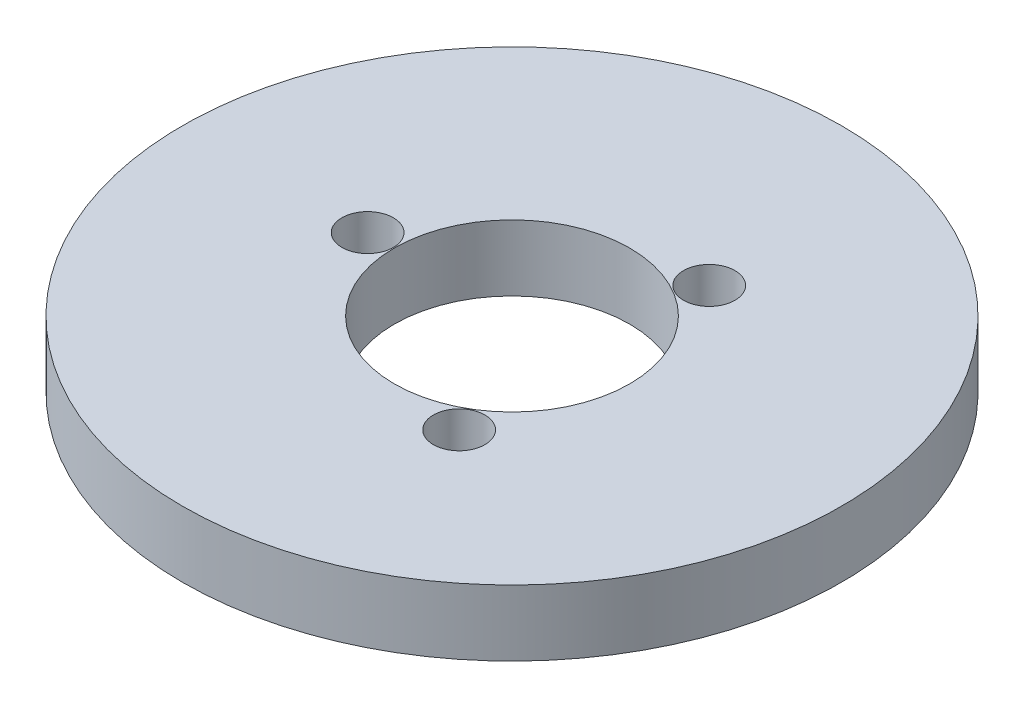
ISO-10303-21;
HEADER;
FILE_DESCRIPTION(('STEP AP214'),'2;1');
FILE_NAME('part.step','',(''),(''),'','','');
FILE_SCHEMA(('AUTOMOTIVE_DESIGN { 1 0 10303 214 1 1 1 1 }'));
ENDSEC;
DATA;
#1=APPLICATION_CONTEXT('core data for automotive mechanical design processes');
#2=APPLICATION_PROTOCOL_DEFINITION('international standard','automotive_design',2000,#1);
#3=PRODUCT_CONTEXT('',#1,'mechanical');
#4=PRODUCT('Part','Part','',(#3));
#5=PRODUCT_RELATED_PRODUCT_CATEGORY('part','',(#4));
#6=PRODUCT_DEFINITION_FORMATION('','',#4);
#7=PRODUCT_DEFINITION_CONTEXT('part definition',#1,'design');
#8=PRODUCT_DEFINITION('design','',#6,#7);
#9=PRODUCT_DEFINITION_SHAPE('','',#8);
#10=(LENGTH_UNIT() NAMED_UNIT(*) SI_UNIT(.MILLI.,.METRE.));
#11=(NAMED_UNIT(*) PLANE_ANGLE_UNIT() SI_UNIT($,.RADIAN.));
#12=(NAMED_UNIT(*) SI_UNIT($,.STERADIAN.) SOLID_ANGLE_UNIT());
#13=UNCERTAINTY_MEASURE_WITH_UNIT(LENGTH_MEASURE(1.E-05),#10,'distance_accuracy_value','');
#14=(GEOMETRIC_REPRESENTATION_CONTEXT(3) GLOBAL_UNCERTAINTY_ASSIGNED_CONTEXT((#13)) GLOBAL_UNIT_ASSIGNED_CONTEXT((#10,
#11,#12)) REPRESENTATION_CONTEXT('',''));
#15=CARTESIAN_POINT('',(0.,0.,0.));
#16=DIRECTION('',(0.,0.,1.));
#17=DIRECTION('',(1.,0.,0.));
#18=AXIS2_PLACEMENT_3D('',#15,#16,#17);
#19=CARTESIAN_POINT('',(0.,7.,0.));
#20=DIRECTION('',(0.,-1.,0.));
#21=DIRECTION('',(0.,0.,-1.));
#22=AXIS2_PLACEMENT_3D('',#19,#20,#21);
#23=CYLINDRICAL_SURFACE('',#22,35.);
#24=CARTESIAN_POINT('',(0.,7.,0.));
#25=DIRECTION('',(0.,1.,0.));
#26=DIRECTION('',(0.,0.,1.));
#27=AXIS2_PLACEMENT_3D('',#24,#25,#26);
#28=CIRCLE('',#27,35.);
#29=CARTESIAN_POINT('',(0.,7.,35.));
#30=VERTEX_POINT('',#29);
#31=EDGE_CURVE('E10',#30,#30,#28,.T.);
#32=ORIENTED_EDGE('',*,*,#31,.F.);
#33=EDGE_LOOP('',(#32));
#34=FACE_BOUND('',#33,.T.);
#35=CARTESIAN_POINT('',(0.,0.,0.));
#36=DIRECTION('',(0.,1.,0.));
#37=DIRECTION('',(0.,0.,1.));
#38=AXIS2_PLACEMENT_3D('',#35,#36,#37);
#39=CIRCLE('',#38,35.);
#40=CARTESIAN_POINT('',(0.,0.,35.));
#41=VERTEX_POINT('',#40);
#42=EDGE_CURVE('E37',#41,#41,#39,.T.);
#43=ORIENTED_EDGE('',*,*,#42,.T.);
#44=EDGE_LOOP('',(#43));
#45=FACE_BOUND('',#44,.T.);
#46=ADVANCED_FACE('F40',(#34,#45),#23,.T.);
#47=CARTESIAN_POINT('',(0.,7.,0.));
#48=DIRECTION('',(0.,1.,0.));
#49=DIRECTION('',(0.,0.,1.));
#50=AXIS2_PLACEMENT_3D('',#47,#48,#49);
#51=PLANE('',#50);
#52=CARTESIAN_POINT('',(7.66677985091047,7.,13.2792522322221));
#53=DIRECTION('',(0.,1.,0.));
#54=DIRECTION('',(0.866025403784436,0.,-0.500000000000004));
#55=AXIS2_PLACEMENT_3D('',#52,#53,#54);
#56=CIRCLE('',#55,2.73449785844293);
#57=CARTESIAN_POINT('',(10.0349244629162,7.,11.9120033030007));
#58=VERTEX_POINT('',#57);
#59=EDGE_CURVE('E70',#58,#58,#56,.T.);
#60=ORIENTED_EDGE('',*,*,#59,.F.);
#61=EDGE_LOOP('',(#60));
#62=FACE_BOUND('',#61,.T.);
#63=CARTESIAN_POINT('',(7.66677985091029,7.,-13.2792522322222));
#64=DIRECTION('',(0.,1.,0.));
#65=DIRECTION('',(-0.866025403784443,0.,-0.499999999999992));
#66=AXIS2_PLACEMENT_3D('',#63,#64,#65);
#67=CIRCLE('',#66,2.73449785844293);
#68=CARTESIAN_POINT('',(5.29863523890455,7.,-14.6465011614437));
#69=VERTEX_POINT('',#68);
#70=EDGE_CURVE('E61',#69,#69,#67,.T.);
#71=ORIENTED_EDGE('',*,*,#70,.F.);
#72=EDGE_LOOP('',(#71));
#73=FACE_BOUND('',#72,.T.);
#74=CARTESIAN_POINT('',(-15.3335597018208,7.,0.));
#75=DIRECTION('',(0.,1.,0.));
#76=DIRECTION('',(0.,0.,1.));
#77=AXIS2_PLACEMENT_3D('',#74,#75,#76);
#78=CIRCLE('',#77,2.73449785844293);
#79=CARTESIAN_POINT('',(-15.3335597018208,7.,2.73449785844293));
#80=VERTEX_POINT('',#79);
#81=EDGE_CURVE('E54',#80,#80,#78,.T.);
#82=ORIENTED_EDGE('',*,*,#81,.F.);
#83=EDGE_LOOP('',(#82));
#84=FACE_BOUND('',#83,.T.);
#85=CARTESIAN_POINT('',(0.,7.,0.));
#86=DIRECTION('',(0.,1.,0.));
#87=DIRECTION('',(0.,0.,1.));
#88=AXIS2_PLACEMENT_3D('',#85,#86,#87);
#89=CIRCLE('',#88,12.5);
#90=CARTESIAN_POINT('',(0.,7.,12.5));
#91=VERTEX_POINT('',#90);
#92=EDGE_CURVE('E50',#91,#91,#89,.T.);
#93=ORIENTED_EDGE('',*,*,#92,.F.);
#94=EDGE_LOOP('',(#93));
#95=FACE_BOUND('',#94,.T.);
#96=ORIENTED_EDGE('',*,*,#31,.T.);
#97=EDGE_LOOP('',(#96));
#98=FACE_BOUND('',#97,.T.);
#99=ADVANCED_FACE('F85',(#62,#73,#84,#95,#98),#51,.T.);
#100=CARTESIAN_POINT('',(0.,0.,0.));
#101=DIRECTION('',(0.,1.,0.));
#102=DIRECTION('',(0.,0.,1.));
#103=AXIS2_PLACEMENT_3D('',#100,#101,#102);
#104=PLANE('',#103);
#105=CARTESIAN_POINT('',(0.,0.,0.));
#106=DIRECTION('',(0.,1.,0.));
#107=DIRECTION('',(0.,0.,1.));
#108=AXIS2_PLACEMENT_3D('',#105,#106,#107);
#109=CIRCLE('',#108,12.5);
#110=CARTESIAN_POINT('',(0.,0.,12.5));
#111=VERTEX_POINT('',#110);
#112=EDGE_CURVE('E47',#111,#111,#109,.T.);
#113=ORIENTED_EDGE('',*,*,#112,.T.);
#114=EDGE_LOOP('',(#113));
#115=FACE_BOUND('',#114,.T.);
#116=ORIENTED_EDGE('',*,*,#42,.F.);
#117=EDGE_LOOP('',(#116));
#118=FACE_BOUND('',#117,.T.);
#119=ADVANCED_FACE('F84',(#115,#118),#104,.F.);
#120=CARTESIAN_POINT('',(0.,7.,0.));
#121=DIRECTION('',(0.,-1.,0.));
#122=DIRECTION('',(0.,0.,-1.));
#123=AXIS2_PLACEMENT_3D('',#120,#121,#122);
#124=CYLINDRICAL_SURFACE('',#123,12.5);
#125=ORIENTED_EDGE('',*,*,#92,.T.);
#126=EDGE_LOOP('',(#125));
#127=FACE_BOUND('',#126,.T.);
#128=ORIENTED_EDGE('',*,*,#112,.F.);
#129=EDGE_LOOP('',(#128));
#130=FACE_BOUND('',#129,.T.);
#131=ADVANCED_FACE('F91',(#127,#130),#124,.F.);
#132=CARTESIAN_POINT('',(-15.3335597018208,1.47656188683083,0.));
#133=DIRECTION('',(0.,1.,0.));
#134=DIRECTION('',(0.,0.,1.));
#135=AXIS2_PLACEMENT_3D('',#132,#133,#134);
#136=CYLINDRICAL_SURFACE('',#135,2.73449785844293);
#137=CARTESIAN_POINT('',(-15.3335597018208,1.47656188683083,0.));
#138=DIRECTION('',(0.,1.,0.));
#139=DIRECTION('',(0.,0.,1.));
#140=AXIS2_PLACEMENT_3D('',#137,#138,#139);
#141=CIRCLE('',#140,2.73449785844293);
#142=CARTESIAN_POINT('',(-15.3335597018208,1.47656188683083,2.73449785844293));
#143=VERTEX_POINT('',#142);
#144=EDGE_CURVE('E55',#143,#143,#141,.T.);
#145=ORIENTED_EDGE('',*,*,#144,.F.);
#146=EDGE_LOOP('',(#145));
#147=FACE_BOUND('',#146,.T.);
#148=ORIENTED_EDGE('',*,*,#81,.T.);
#149=EDGE_LOOP('',(#148));
#150=FACE_BOUND('',#149,.T.);
#151=ADVANCED_FACE('F96',(#147,#150),#136,.F.);
#152=CARTESIAN_POINT('',(-15.3335597018208,1.47656188683083,0.));
#153=DIRECTION('',(0.,1.,0.));
#154=DIRECTION('',(0.,0.,1.));
#155=AXIS2_PLACEMENT_3D('',#152,#153,#154);
#156=PLANE('',#155);
#157=ORIENTED_EDGE('',*,*,#144,.T.);
#158=EDGE_LOOP('',(#157));
#159=FACE_BOUND('',#158,.T.);
#160=ADVANCED_FACE('F127',(#159),#156,.T.);
#161=CARTESIAN_POINT('',(7.66677985091029,1.47656188683083,-13.2792522322222));
#162=DIRECTION('',(0.,1.,0.));
#163=DIRECTION('',(0.,0.,1.));
#164=AXIS2_PLACEMENT_3D('',#161,#162,#163);
#165=CYLINDRICAL_SURFACE('',#164,2.73449785844293);
#166=CARTESIAN_POINT('',(7.66677985091029,1.47656188683083,-13.2792522322222));
#167=DIRECTION('',(0.,1.,0.));
#168=DIRECTION('',(-0.866025403784443,0.,-0.499999999999992));
#169=AXIS2_PLACEMENT_3D('',#166,#167,#168);
#170=CIRCLE('',#169,2.73449785844293);
#171=CARTESIAN_POINT('',(5.29863523890455,1.47656188683083,-14.6465011614437));
#172=VERTEX_POINT('',#171);
#173=EDGE_CURVE('E63',#172,#172,#170,.T.);
#174=ORIENTED_EDGE('',*,*,#173,.F.);
#175=EDGE_LOOP('',(#174));
#176=FACE_BOUND('',#175,.T.);
#177=ORIENTED_EDGE('',*,*,#70,.T.);
#178=EDGE_LOOP('',(#177));
#179=FACE_BOUND('',#178,.T.);
#180=ADVANCED_FACE('F133',(#176,#179),#165,.F.);
#181=CARTESIAN_POINT('',(7.66677985091029,1.47656188683083,-13.2792522322222));
#182=DIRECTION('',(0.,1.,0.));
#183=DIRECTION('',(-0.866025403784443,0.,-0.499999999999992));
#184=AXIS2_PLACEMENT_3D('',#181,#182,#183);
#185=PLANE('',#184);
#186=ORIENTED_EDGE('',*,*,#173,.T.);
#187=EDGE_LOOP('',(#186));
#188=FACE_BOUND('',#187,.T.);
#189=ADVANCED_FACE('F77',(#188),#185,.T.);
#190=CARTESIAN_POINT('',(7.66677985091047,1.47656188683083,13.2792522322221));
#191=DIRECTION('',(0.,1.,0.));
#192=DIRECTION('',(0.,0.,1.));
#193=AXIS2_PLACEMENT_3D('',#190,#191,#192);
#194=CYLINDRICAL_SURFACE('',#193,2.73449785844293);
#195=CARTESIAN_POINT('',(7.66677985091047,1.47656188683083,13.2792522322221));
#196=DIRECTION('',(0.,1.,0.));
#197=DIRECTION('',(0.866025403784436,0.,-0.500000000000004));
#198=AXIS2_PLACEMENT_3D('',#195,#196,#197);
#199=CIRCLE('',#198,2.73449785844293);
#200=CARTESIAN_POINT('',(10.0349244629162,1.47656188683083,11.9120033030007));
#201=VERTEX_POINT('',#200);
#202=EDGE_CURVE('E59',#201,#201,#199,.T.);
#203=ORIENTED_EDGE('',*,*,#202,.F.);
#204=EDGE_LOOP('',(#203));
#205=FACE_BOUND('',#204,.T.);
#206=ORIENTED_EDGE('',*,*,#59,.T.);
#207=EDGE_LOOP('',(#206));
#208=FACE_BOUND('',#207,.T.);
#209=ADVANCED_FACE('F73',(#205,#208),#194,.F.);
#210=CARTESIAN_POINT('',(7.66677985091047,1.47656188683083,13.2792522322221));
#211=DIRECTION('',(0.,1.,0.));
#212=DIRECTION('',(0.866025403784436,0.,-0.500000000000004));
#213=AXIS2_PLACEMENT_3D('',#210,#211,#212);
#214=PLANE('',#213);
#215=ORIENTED_EDGE('',*,*,#202,.T.);
#216=EDGE_LOOP('',(#215));
#217=FACE_BOUND('',#216,.T.);
#218=ADVANCED_FACE('F71',(#217),#214,.T.);
#219=CLOSED_SHELL('',(#46,#99,#119,#131,#151,#160,#180,#189,#209,#218));
#220=MANIFOLD_SOLID_BREP('B2',#219);
#221=ADVANCED_BREP_SHAPE_REPRESENTATION('',(#18,#220),#14);
#222=SHAPE_DEFINITION_REPRESENTATION(#9,#221);
ENDSEC;
END-ISO-10303-21;
